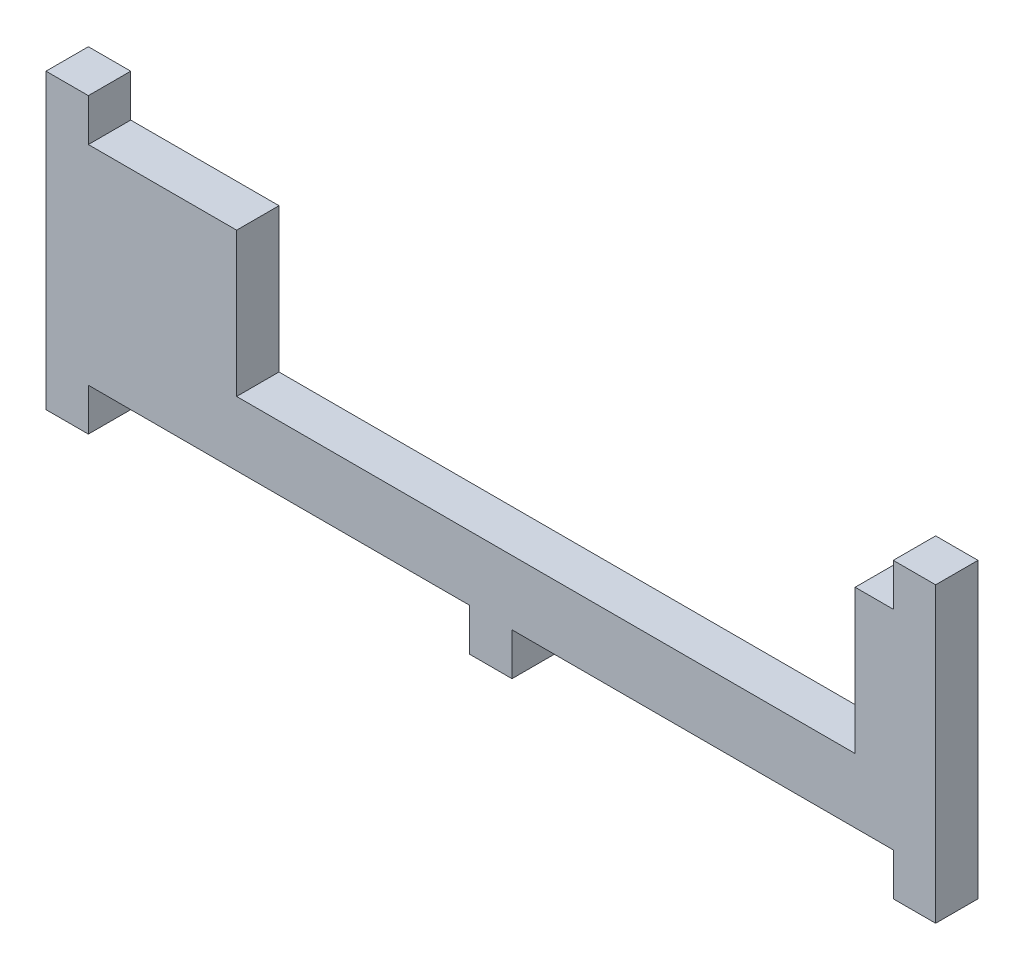
ISO-10303-21;
HEADER;
FILE_DESCRIPTION(('STEP AP214'),'2;1');
FILE_NAME('part.step','',(''),(''),'','','');
FILE_SCHEMA(('AUTOMOTIVE_DESIGN { 1 0 10303 214 1 1 1 1 }'));
ENDSEC;
DATA;
#1=APPLICATION_CONTEXT('core data for automotive mechanical design processes');
#2=APPLICATION_PROTOCOL_DEFINITION('international standard','automotive_design',2000,#1);
#3=PRODUCT_CONTEXT('',#1,'mechanical');
#4=PRODUCT('Part','Part','',(#3));
#5=PRODUCT_RELATED_PRODUCT_CATEGORY('part','',(#4));
#6=PRODUCT_DEFINITION_FORMATION('','',#4);
#7=PRODUCT_DEFINITION_CONTEXT('part definition',#1,'design');
#8=PRODUCT_DEFINITION('design','',#6,#7);
#9=PRODUCT_DEFINITION_SHAPE('','',#8);
#10=(LENGTH_UNIT() NAMED_UNIT(*) SI_UNIT(.MILLI.,.METRE.));
#11=(NAMED_UNIT(*) PLANE_ANGLE_UNIT() SI_UNIT($,.RADIAN.));
#12=(NAMED_UNIT(*) SI_UNIT($,.STERADIAN.) SOLID_ANGLE_UNIT());
#13=UNCERTAINTY_MEASURE_WITH_UNIT(LENGTH_MEASURE(1.E-05),#10,'distance_accuracy_value','');
#14=(GEOMETRIC_REPRESENTATION_CONTEXT(3) GLOBAL_UNCERTAINTY_ASSIGNED_CONTEXT((#13)) GLOBAL_UNIT_ASSIGNED_CONTEXT((#10,
#11,#12)) REPRESENTATION_CONTEXT('',''));
#15=CARTESIAN_POINT('',(0.,0.,0.));
#16=DIRECTION('',(0.,0.,1.));
#17=DIRECTION('',(1.,0.,0.));
#18=AXIS2_PLACEMENT_3D('',#15,#16,#17);
#19=CARTESIAN_POINT('',(-52.5,-6.15,5.));
#20=DIRECTION('',(0.,1.,0.));
#21=DIRECTION('',(0.,0.,1.));
#22=AXIS2_PLACEMENT_3D('',#19,#20,#21);
#23=PLANE('',#22);
#24=DIRECTION('',(0.,0.,-1.));
#25=VECTOR('',#24,1.);
#26=CARTESIAN_POINT('',(-2.5,-6.15,5.));
#27=LINE('',#26,#25);
#28=CARTESIAN_POINT('',(-2.5,-6.15,5.));
#29=VERTEX_POINT('',#28);
#30=CARTESIAN_POINT('',(-2.5,-6.15,0.));
#31=VERTEX_POINT('',#30);
#32=EDGE_CURVE('E58',#29,#31,#27,.T.);
#33=ORIENTED_EDGE('',*,*,#32,.F.);
#34=DIRECTION('',(1.,0.,0.));
#35=VECTOR('',#34,1.);
#36=CARTESIAN_POINT('',(-52.5,-6.15,5.));
#37=LINE('',#36,#35);
#38=CARTESIAN_POINT('',(-47.5,-6.15,5.));
#39=VERTEX_POINT('',#38);
#40=EDGE_CURVE('E12',#39,#29,#37,.T.);
#41=ORIENTED_EDGE('',*,*,#40,.F.);
#42=DIRECTION('',(0.,0.,1.));
#43=VECTOR('',#42,1.);
#44=CARTESIAN_POINT('',(-47.5,-6.15,5.));
#45=LINE('',#44,#43);
#46=CARTESIAN_POINT('',(-47.5,-6.15,0.));
#47=VERTEX_POINT('',#46);
#48=EDGE_CURVE('E298',#47,#39,#45,.T.);
#49=ORIENTED_EDGE('',*,*,#48,.F.);
#50=DIRECTION('',(1.,0.,0.));
#51=VECTOR('',#50,1.);
#52=CARTESIAN_POINT('',(-52.5,-6.15,0.));
#53=LINE('',#52,#51);
#54=EDGE_CURVE('E376',#47,#31,#53,.T.);
#55=ORIENTED_EDGE('',*,*,#54,.T.);
#56=EDGE_LOOP('',(#33,#41,#49,#55));
#57=FACE_BOUND('',#56,.T.);
#58=ADVANCED_FACE('F34',(#57),#23,.F.);
#59=DIRECTION('',(0.,0.,1.));
#60=VECTOR('',#59,1.);
#61=CARTESIAN_POINT('',(2.5,-6.15,5.));
#62=LINE('',#61,#60);
#63=CARTESIAN_POINT('',(2.50000000000001,-6.15,0.));
#64=VERTEX_POINT('',#63);
#65=CARTESIAN_POINT('',(2.50000000000001,-6.15,5.));
#66=VERTEX_POINT('',#65);
#67=EDGE_CURVE('E193',#64,#66,#62,.T.);
#68=ORIENTED_EDGE('',*,*,#67,.F.);
#69=CARTESIAN_POINT('',(47.5,-6.15,0.));
#70=VERTEX_POINT('',#69);
#71=EDGE_CURVE('E371',#64,#70,#53,.T.);
#72=ORIENTED_EDGE('',*,*,#71,.T.);
#73=DIRECTION('',(0.,0.,-1.));
#74=VECTOR('',#73,1.);
#75=CARTESIAN_POINT('',(47.5,-6.15,5.));
#76=LINE('',#75,#74);
#77=CARTESIAN_POINT('',(47.5,-6.15,5.));
#78=VERTEX_POINT('',#77);
#79=EDGE_CURVE('E282',#78,#70,#76,.T.);
#80=ORIENTED_EDGE('',*,*,#79,.F.);
#81=EDGE_CURVE('E38',#66,#78,#37,.T.);
#82=ORIENTED_EDGE('',*,*,#81,.F.);
#83=EDGE_LOOP('',(#68,#72,#80,#82));
#84=FACE_BOUND('',#83,.T.);
#85=ADVANCED_FACE('F385',(#84),#23,.F.);
#86=CARTESIAN_POINT('',(-52.5,18.45,5.));
#87=DIRECTION('',(0.,-1.,0.));
#88=DIRECTION('',(0.,0.,1.));
#89=AXIS2_PLACEMENT_3D('',#86,#87,#88);
#90=PLANE('',#89);
#91=DIRECTION('',(1.,0.,0.));
#92=VECTOR('',#91,1.);
#93=CARTESIAN_POINT('',(-52.5,18.45,5.));
#94=LINE('',#93,#92);
#95=CARTESIAN_POINT('',(-47.5,18.45,5.));
#96=VERTEX_POINT('',#95);
#97=CARTESIAN_POINT('',(-30.,18.45,5.));
#98=VERTEX_POINT('',#97);
#99=EDGE_CURVE('E268',#96,#98,#94,.T.);
#100=ORIENTED_EDGE('',*,*,#99,.T.);
#101=DIRECTION('',(0.,0.,1.));
#102=VECTOR('',#101,1.);
#103=CARTESIAN_POINT('',(-30.,18.45,0.));
#104=LINE('',#103,#102);
#105=CARTESIAN_POINT('',(-30.,18.45,0.));
#106=VERTEX_POINT('',#105);
#107=EDGE_CURVE('E196',#106,#98,#104,.T.);
#108=ORIENTED_EDGE('',*,*,#107,.F.);
#109=DIRECTION('',(1.,0.,0.));
#110=VECTOR('',#109,1.);
#111=CARTESIAN_POINT('',(-52.5,18.45,0.));
#112=LINE('',#111,#110);
#113=CARTESIAN_POINT('',(-47.5,18.45,0.));
#114=VERTEX_POINT('',#113);
#115=EDGE_CURVE('E329',#114,#106,#112,.T.);
#116=ORIENTED_EDGE('',*,*,#115,.F.);
#117=DIRECTION('',(0.,0.,1.));
#118=VECTOR('',#117,1.);
#119=CARTESIAN_POINT('',(-47.5,18.45,5.));
#120=LINE('',#119,#118);
#121=EDGE_CURVE('E247',#114,#96,#120,.T.);
#122=ORIENTED_EDGE('',*,*,#121,.T.);
#123=EDGE_LOOP('',(#100,#108,#116,#122));
#124=FACE_BOUND('',#123,.T.);
#125=ADVANCED_FACE('F342',(#124),#90,.F.);
#126=CARTESIAN_POINT('',(52.5,-6.15,5.));
#127=DIRECTION('',(-1.,0.,0.));
#128=DIRECTION('',(0.,0.,1.));
#129=AXIS2_PLACEMENT_3D('',#126,#127,#128);
#130=PLANE('',#129);
#131=DIRECTION('',(0.,1.,0.));
#132=VECTOR('',#131,1.);
#133=CARTESIAN_POINT('',(52.5,-6.15,0.));
#134=LINE('',#133,#132);
#135=CARTESIAN_POINT('',(52.5,-11.15,0.));
#136=VERTEX_POINT('',#135);
#137=CARTESIAN_POINT('',(52.5,23.45,0.));
#138=VERTEX_POINT('',#137);
#139=EDGE_CURVE('E325',#136,#138,#134,.T.);
#140=ORIENTED_EDGE('',*,*,#139,.T.);
#141=DIRECTION('',(0.,0.,1.));
#142=VECTOR('',#141,1.);
#143=CARTESIAN_POINT('',(52.5,23.45,5.));
#144=LINE('',#143,#142);
#145=CARTESIAN_POINT('',(52.5,23.45,5.));
#146=VERTEX_POINT('',#145);
#147=EDGE_CURVE('E233',#138,#146,#144,.T.);
#148=ORIENTED_EDGE('',*,*,#147,.T.);
#149=DIRECTION('',(0.,1.,0.));
#150=VECTOR('',#149,1.);
#151=CARTESIAN_POINT('',(52.5,-6.15,5.));
#152=LINE('',#151,#150);
#153=CARTESIAN_POINT('',(52.5,-11.15,5.));
#154=VERTEX_POINT('',#153);
#155=EDGE_CURVE('E312',#154,#146,#152,.T.);
#156=ORIENTED_EDGE('',*,*,#155,.F.);
#157=DIRECTION('',(0.,0.,1.));
#158=VECTOR('',#157,1.);
#159=CARTESIAN_POINT('',(52.5,-11.15,5.));
#160=LINE('',#159,#158);
#161=EDGE_CURVE('E285',#136,#154,#160,.T.);
#162=ORIENTED_EDGE('',*,*,#161,.F.);
#163=EDGE_LOOP('',(#140,#148,#156,#162));
#164=FACE_BOUND('',#163,.T.);
#165=ADVANCED_FACE('F36',(#164),#130,.F.);
#166=CARTESIAN_POINT('',(-52.5,-6.15,5.));
#167=DIRECTION('',(1.,0.,0.));
#168=DIRECTION('',(0.,0.,-1.));
#169=AXIS2_PLACEMENT_3D('',#166,#167,#168);
#170=PLANE('',#169);
#171=DIRECTION('',(0.,-1.,0.));
#172=VECTOR('',#171,1.);
#173=CARTESIAN_POINT('',(-52.5,-6.15,0.));
#174=LINE('',#173,#172);
#175=CARTESIAN_POINT('',(-52.5,23.45,0.));
#176=VERTEX_POINT('',#175);
#177=CARTESIAN_POINT('',(-52.5,-11.15,0.));
#178=VERTEX_POINT('',#177);
#179=EDGE_CURVE('E369',#176,#178,#174,.T.);
#180=ORIENTED_EDGE('',*,*,#179,.T.);
#181=DIRECTION('',(0.,0.,-1.));
#182=VECTOR('',#181,1.);
#183=CARTESIAN_POINT('',(-52.5,-11.15,5.));
#184=LINE('',#183,#182);
#185=CARTESIAN_POINT('',(-52.5,-11.15,5.));
#186=VERTEX_POINT('',#185);
#187=EDGE_CURVE('E299',#186,#178,#184,.T.);
#188=ORIENTED_EDGE('',*,*,#187,.F.);
#189=DIRECTION('',(0.,-1.,0.));
#190=VECTOR('',#189,1.);
#191=CARTESIAN_POINT('',(-52.5,-6.15,5.));
#192=LINE('',#191,#190);
#193=CARTESIAN_POINT('',(-52.5,23.45,5.));
#194=VERTEX_POINT('',#193);
#195=EDGE_CURVE('E378',#194,#186,#192,.T.);
#196=ORIENTED_EDGE('',*,*,#195,.F.);
#197=DIRECTION('',(0.,0.,-1.));
#198=VECTOR('',#197,1.);
#199=CARTESIAN_POINT('',(-52.5,23.45,5.));
#200=LINE('',#199,#198);
#201=EDGE_CURVE('E248',#194,#176,#200,.T.);
#202=ORIENTED_EDGE('',*,*,#201,.T.);
#203=EDGE_LOOP('',(#180,#188,#196,#202));
#204=FACE_BOUND('',#203,.T.);
#205=ADVANCED_FACE('F410',(#204),#170,.F.);
#206=CARTESIAN_POINT('',(0.,0.,5.));
#207=DIRECTION('',(0.,0.,-1.));
#208=DIRECTION('',(-1.,0.,0.));
#209=AXIS2_PLACEMENT_3D('',#206,#207,#208);
#210=PLANE('',#209);
#211=DIRECTION('',(1.,0.,0.));
#212=VECTOR('',#211,1.);
#213=CARTESIAN_POINT('',(-30.,1.45,5.));
#214=LINE('',#213,#212);
#215=CARTESIAN_POINT('',(-30.,1.45,5.));
#216=VERTEX_POINT('',#215);
#217=CARTESIAN_POINT('',(43.,1.45,5.));
#218=VERTEX_POINT('',#217);
#219=EDGE_CURVE('E207',#216,#218,#214,.T.);
#220=ORIENTED_EDGE('',*,*,#219,.F.);
#221=DIRECTION('',(0.,1.,0.));
#222=VECTOR('',#221,1.);
#223=CARTESIAN_POINT('',(-30.,1.45,5.));
#224=LINE('',#223,#222);
#225=EDGE_CURVE('E215',#216,#98,#224,.T.);
#226=ORIENTED_EDGE('',*,*,#225,.T.);
#227=ORIENTED_EDGE('',*,*,#99,.F.);
#228=DIRECTION('',(0.,-1.,0.));
#229=VECTOR('',#228,1.);
#230=CARTESIAN_POINT('',(-47.5,23.45,5.));
#231=LINE('',#230,#229);
#232=CARTESIAN_POINT('',(-47.5,23.45,5.));
#233=VERTEX_POINT('',#232);
#234=EDGE_CURVE('E259',#233,#96,#231,.T.);
#235=ORIENTED_EDGE('',*,*,#234,.F.);
#236=DIRECTION('',(-1.,0.,0.));
#237=VECTOR('',#236,1.);
#238=CARTESIAN_POINT('',(-52.5,23.45,5.));
#239=LINE('',#238,#237);
#240=EDGE_CURVE('E256',#233,#194,#239,.T.);
#241=ORIENTED_EDGE('',*,*,#240,.T.);
#242=ORIENTED_EDGE('',*,*,#195,.T.);
#243=DIRECTION('',(-1.,0.,0.));
#244=VECTOR('',#243,1.);
#245=CARTESIAN_POINT('',(-52.5,-11.15,5.));
#246=LINE('',#245,#244);
#247=CARTESIAN_POINT('',(-47.5,-11.15,5.));
#248=VERTEX_POINT('',#247);
#249=EDGE_CURVE('E306',#248,#186,#246,.T.);
#250=ORIENTED_EDGE('',*,*,#249,.F.);
#251=DIRECTION('',(0.,1.,0.));
#252=VECTOR('',#251,1.);
#253=CARTESIAN_POINT('',(-47.5,-11.15,5.));
#254=LINE('',#253,#252);
#255=EDGE_CURVE('E309',#248,#39,#254,.T.);
#256=ORIENTED_EDGE('',*,*,#255,.T.);
#257=ORIENTED_EDGE('',*,*,#40,.T.);
#258=DIRECTION('',(0.,1.,0.));
#259=VECTOR('',#258,1.);
#260=CARTESIAN_POINT('',(-2.5,-11.15,5.));
#261=LINE('',#260,#259);
#262=CARTESIAN_POINT('',(-2.5,-11.15,5.));
#263=VERTEX_POINT('',#262);
#264=EDGE_CURVE('E395',#263,#29,#261,.T.);
#265=ORIENTED_EDGE('',*,*,#264,.F.);
#266=DIRECTION('',(-1.,0.,0.));
#267=VECTOR('',#266,1.);
#268=CARTESIAN_POINT('',(-2.5,-11.15,5.));
#269=LINE('',#268,#267);
#270=CARTESIAN_POINT('',(2.5,-11.15,5.));
#271=VERTEX_POINT('',#270);
#272=EDGE_CURVE('E189',#271,#263,#269,.T.);
#273=ORIENTED_EDGE('',*,*,#272,.F.);
#274=DIRECTION('',(0.,1.,0.));
#275=VECTOR('',#274,1.);
#276=CARTESIAN_POINT('',(2.5,-11.15,5.));
#277=LINE('',#276,#275);
#278=EDGE_CURVE('E200',#271,#66,#277,.T.);
#279=ORIENTED_EDGE('',*,*,#278,.T.);
#280=ORIENTED_EDGE('',*,*,#81,.T.);
#281=DIRECTION('',(0.,1.,0.));
#282=VECTOR('',#281,1.);
#283=CARTESIAN_POINT('',(47.5,-11.15,5.));
#284=LINE('',#283,#282);
#285=CARTESIAN_POINT('',(47.5,-11.15,5.));
#286=VERTEX_POINT('',#285);
#287=EDGE_CURVE('E290',#286,#78,#284,.T.);
#288=ORIENTED_EDGE('',*,*,#287,.F.);
#289=DIRECTION('',(-1.,0.,0.));
#290=VECTOR('',#289,1.);
#291=CARTESIAN_POINT('',(47.5,-11.15,5.));
#292=LINE('',#291,#290);
#293=EDGE_CURVE('E288',#154,#286,#292,.T.);
#294=ORIENTED_EDGE('',*,*,#293,.F.);
#295=ORIENTED_EDGE('',*,*,#155,.T.);
#296=DIRECTION('',(-1.,0.,0.));
#297=VECTOR('',#296,1.);
#298=CARTESIAN_POINT('',(47.5,23.45,5.));
#299=LINE('',#298,#297);
#300=CARTESIAN_POINT('',(47.5,23.45,5.));
#301=VERTEX_POINT('',#300);
#302=EDGE_CURVE('E236',#146,#301,#299,.T.);
#303=ORIENTED_EDGE('',*,*,#302,.T.);
#304=DIRECTION('',(0.,-1.,0.));
#305=VECTOR('',#304,1.);
#306=CARTESIAN_POINT('',(47.5,23.45,5.));
#307=LINE('',#306,#305);
#308=CARTESIAN_POINT('',(47.5,18.45,5.));
#309=VERTEX_POINT('',#308);
#310=EDGE_CURVE('E239',#301,#309,#307,.T.);
#311=ORIENTED_EDGE('',*,*,#310,.T.);
#312=CARTESIAN_POINT('',(43.,18.45,5.));
#313=VERTEX_POINT('',#312);
#314=EDGE_CURVE('E330',#313,#309,#94,.T.);
#315=ORIENTED_EDGE('',*,*,#314,.F.);
#316=DIRECTION('',(0.,1.,0.));
#317=VECTOR('',#316,1.);
#318=CARTESIAN_POINT('',(43.,1.45,5.));
#319=LINE('',#318,#317);
#320=EDGE_CURVE('E224',#218,#313,#319,.T.);
#321=ORIENTED_EDGE('',*,*,#320,.F.);
#322=EDGE_LOOP('',(#220,#226,#227,#235,#241,#242,#250,#256,#257,#265,#273,#279,#280,#288,#294,
#295,#303,#311,#315,#321));
#323=FACE_BOUND('',#322,.T.);
#324=ADVANCED_FACE('F347',(#323),#210,.F.);
#325=CARTESIAN_POINT('',(0.,0.,0.));
#326=DIRECTION('',(0.,0.,-1.));
#327=DIRECTION('',(-1.,0.,0.));
#328=AXIS2_PLACEMENT_3D('',#325,#326,#327);
#329=PLANE('',#328);
#330=DIRECTION('',(0.,1.,0.));
#331=VECTOR('',#330,1.);
#332=CARTESIAN_POINT('',(-30.,1.45,0.));
#333=LINE('',#332,#331);
#334=CARTESIAN_POINT('',(-30.,1.45,0.));
#335=VERTEX_POINT('',#334);
#336=EDGE_CURVE('E218',#335,#106,#333,.T.);
#337=ORIENTED_EDGE('',*,*,#336,.F.);
#338=DIRECTION('',(-1.,0.,0.));
#339=VECTOR('',#338,1.);
#340=CARTESIAN_POINT('',(-30.,1.45,0.));
#341=LINE('',#340,#339);
#342=CARTESIAN_POINT('',(43.,1.45,0.));
#343=VERTEX_POINT('',#342);
#344=EDGE_CURVE('E213',#343,#335,#341,.T.);
#345=ORIENTED_EDGE('',*,*,#344,.F.);
#346=DIRECTION('',(0.,1.,0.));
#347=VECTOR('',#346,1.);
#348=CARTESIAN_POINT('',(43.,1.45,0.));
#349=LINE('',#348,#347);
#350=CARTESIAN_POINT('',(43.,18.45,0.));
#351=VERTEX_POINT('',#350);
#352=EDGE_CURVE('E221',#343,#351,#349,.T.);
#353=ORIENTED_EDGE('',*,*,#352,.T.);
#354=CARTESIAN_POINT('',(47.5,18.45,0.));
#355=VERTEX_POINT('',#354);
#356=EDGE_CURVE('E275',#351,#355,#112,.T.);
#357=ORIENTED_EDGE('',*,*,#356,.T.);
#358=DIRECTION('',(0.,-1.,0.));
#359=VECTOR('',#358,1.);
#360=CARTESIAN_POINT('',(47.5,23.45,0.));
#361=LINE('',#360,#359);
#362=CARTESIAN_POINT('',(47.5,23.45,0.));
#363=VERTEX_POINT('',#362);
#364=EDGE_CURVE('E244',#363,#355,#361,.T.);
#365=ORIENTED_EDGE('',*,*,#364,.F.);
#366=DIRECTION('',(1.,0.,0.));
#367=VECTOR('',#366,1.);
#368=CARTESIAN_POINT('',(47.5,23.45,0.));
#369=LINE('',#368,#367);
#370=EDGE_CURVE('E230',#363,#138,#369,.T.);
#371=ORIENTED_EDGE('',*,*,#370,.T.);
#372=ORIENTED_EDGE('',*,*,#139,.F.);
#373=DIRECTION('',(1.,0.,0.));
#374=VECTOR('',#373,1.);
#375=CARTESIAN_POINT('',(47.5,-11.15,0.));
#376=LINE('',#375,#374);
#377=CARTESIAN_POINT('',(47.5,-11.15,0.));
#378=VERTEX_POINT('',#377);
#379=EDGE_CURVE('E281',#378,#136,#376,.T.);
#380=ORIENTED_EDGE('',*,*,#379,.F.);
#381=DIRECTION('',(0.,1.,0.));
#382=VECTOR('',#381,1.);
#383=CARTESIAN_POINT('',(47.5,-11.15,0.));
#384=LINE('',#383,#382);
#385=EDGE_CURVE('E295',#378,#70,#384,.T.);
#386=ORIENTED_EDGE('',*,*,#385,.T.);
#387=ORIENTED_EDGE('',*,*,#71,.F.);
#388=DIRECTION('',(0.,1.,0.));
#389=VECTOR('',#388,1.);
#390=CARTESIAN_POINT('',(2.50000000000001,-11.15,0.));
#391=LINE('',#390,#389);
#392=CARTESIAN_POINT('',(2.50000000000001,-11.15,0.));
#393=VERTEX_POINT('',#392);
#394=EDGE_CURVE('E180',#393,#64,#391,.T.);
#395=ORIENTED_EDGE('',*,*,#394,.F.);
#396=DIRECTION('',(1.,0.,0.));
#397=VECTOR('',#396,1.);
#398=CARTESIAN_POINT('',(-2.5,-11.15,0.));
#399=LINE('',#398,#397);
#400=CARTESIAN_POINT('',(-2.5,-11.15,0.));
#401=VERTEX_POINT('',#400);
#402=EDGE_CURVE('E172',#401,#393,#399,.T.);
#403=ORIENTED_EDGE('',*,*,#402,.F.);
#404=DIRECTION('',(0.,1.,0.));
#405=VECTOR('',#404,1.);
#406=CARTESIAN_POINT('',(-2.5,-11.15,0.));
#407=LINE('',#406,#405);
#408=EDGE_CURVE('E178',#401,#31,#407,.T.);
#409=ORIENTED_EDGE('',*,*,#408,.T.);
#410=ORIENTED_EDGE('',*,*,#54,.F.);
#411=DIRECTION('',(0.,1.,0.));
#412=VECTOR('',#411,1.);
#413=CARTESIAN_POINT('',(-47.5,-11.15,0.));
#414=LINE('',#413,#412);
#415=CARTESIAN_POINT('',(-47.5,-11.15,0.));
#416=VERTEX_POINT('',#415);
#417=EDGE_CURVE('E320',#416,#47,#414,.T.);
#418=ORIENTED_EDGE('',*,*,#417,.F.);
#419=DIRECTION('',(1.,0.,0.));
#420=VECTOR('',#419,1.);
#421=CARTESIAN_POINT('',(-52.5,-11.15,0.));
#422=LINE('',#421,#420);
#423=EDGE_CURVE('E302',#178,#416,#422,.T.);
#424=ORIENTED_EDGE('',*,*,#423,.F.);
#425=ORIENTED_EDGE('',*,*,#179,.F.);
#426=DIRECTION('',(1.,0.,0.));
#427=VECTOR('',#426,1.);
#428=CARTESIAN_POINT('',(-52.5,23.45,0.));
#429=LINE('',#428,#427);
#430=CARTESIAN_POINT('',(-47.5,23.45,0.));
#431=VERTEX_POINT('',#430);
#432=EDGE_CURVE('E251',#176,#431,#429,.T.);
#433=ORIENTED_EDGE('',*,*,#432,.T.);
#434=DIRECTION('',(0.,-1.,0.));
#435=VECTOR('',#434,1.);
#436=CARTESIAN_POINT('',(-47.5,23.45,0.));
#437=LINE('',#436,#435);
#438=EDGE_CURVE('E271',#431,#114,#437,.T.);
#439=ORIENTED_EDGE('',*,*,#438,.T.);
#440=ORIENTED_EDGE('',*,*,#115,.T.);
#441=EDGE_LOOP('',(#337,#345,#353,#357,#365,#371,#372,#380,#386,#387,#395,#403,#409,#410,#418,
#424,#425,#433,#439,#440));
#442=FACE_BOUND('',#441,.T.);
#443=ADVANCED_FACE('F175',(#442),#329,.T.);
#444=CARTESIAN_POINT('',(-47.5,-11.15,5.));
#445=DIRECTION('',(-1.,0.,0.));
#446=DIRECTION('',(0.,0.,1.));
#447=AXIS2_PLACEMENT_3D('',#444,#445,#446);
#448=PLANE('',#447);
#449=ORIENTED_EDGE('',*,*,#48,.T.);
#450=ORIENTED_EDGE('',*,*,#255,.F.);
#451=DIRECTION('',(0.,0.,1.));
#452=VECTOR('',#451,1.);
#453=CARTESIAN_POINT('',(-47.5,-11.15,5.));
#454=LINE('',#453,#452);
#455=EDGE_CURVE('E304',#416,#248,#454,.T.);
#456=ORIENTED_EDGE('',*,*,#455,.F.);
#457=ORIENTED_EDGE('',*,*,#417,.T.);
#458=EDGE_LOOP('',(#449,#450,#456,#457));
#459=FACE_BOUND('',#458,.T.);
#460=ADVANCED_FACE('F401',(#459),#448,.F.);
#461=CARTESIAN_POINT('',(0.,-11.15,0.));
#462=DIRECTION('',(0.,-1.,0.));
#463=DIRECTION('',(0.,0.,-1.));
#464=AXIS2_PLACEMENT_3D('',#461,#462,#463);
#465=PLANE('',#464);
#466=ORIENTED_EDGE('',*,*,#187,.T.);
#467=ORIENTED_EDGE('',*,*,#423,.T.);
#468=ORIENTED_EDGE('',*,*,#455,.T.);
#469=ORIENTED_EDGE('',*,*,#249,.T.);
#470=EDGE_LOOP('',(#466,#467,#468,#469));
#471=FACE_BOUND('',#470,.T.);
#472=ADVANCED_FACE('F408',(#471),#465,.T.);
#473=CARTESIAN_POINT('',(47.5,-11.15,5.));
#474=DIRECTION('',(1.,0.,0.));
#475=DIRECTION('',(0.,0.,-1.));
#476=AXIS2_PLACEMENT_3D('',#473,#474,#475);
#477=PLANE('',#476);
#478=ORIENTED_EDGE('',*,*,#79,.T.);
#479=ORIENTED_EDGE('',*,*,#385,.F.);
#480=DIRECTION('',(0.,0.,-1.));
#481=VECTOR('',#480,1.);
#482=CARTESIAN_POINT('',(47.5,-11.15,5.));
#483=LINE('',#482,#481);
#484=EDGE_CURVE('E278',#286,#378,#483,.T.);
#485=ORIENTED_EDGE('',*,*,#484,.F.);
#486=ORIENTED_EDGE('',*,*,#287,.T.);
#487=EDGE_LOOP('',(#478,#479,#485,#486));
#488=FACE_BOUND('',#487,.T.);
#489=ADVANCED_FACE('F388',(#488),#477,.F.);
#490=CARTESIAN_POINT('',(0.,-11.15,0.));
#491=DIRECTION('',(0.,-1.,0.));
#492=DIRECTION('',(0.,0.,-1.));
#493=AXIS2_PLACEMENT_3D('',#490,#491,#492);
#494=PLANE('',#493);
#495=ORIENTED_EDGE('',*,*,#484,.T.);
#496=ORIENTED_EDGE('',*,*,#379,.T.);
#497=ORIENTED_EDGE('',*,*,#161,.T.);
#498=ORIENTED_EDGE('',*,*,#293,.T.);
#499=EDGE_LOOP('',(#495,#496,#497,#498));
#500=FACE_BOUND('',#499,.T.);
#501=ADVANCED_FACE('F390',(#500),#494,.T.);
#502=ORIENTED_EDGE('',*,*,#356,.F.);
#503=DIRECTION('',(0.,0.,-1.));
#504=VECTOR('',#503,1.);
#505=CARTESIAN_POINT('',(43.,18.45,0.));
#506=LINE('',#505,#504);
#507=EDGE_CURVE('E198',#313,#351,#506,.T.);
#508=ORIENTED_EDGE('',*,*,#507,.F.);
#509=ORIENTED_EDGE('',*,*,#314,.T.);
#510=DIRECTION('',(0.,0.,-1.));
#511=VECTOR('',#510,1.);
#512=CARTESIAN_POINT('',(47.5,18.45,5.));
#513=LINE('',#512,#511);
#514=EDGE_CURVE('E220',#309,#355,#513,.T.);
#515=ORIENTED_EDGE('',*,*,#514,.T.);
#516=EDGE_LOOP('',(#502,#508,#509,#515));
#517=FACE_BOUND('',#516,.T.);
#518=ADVANCED_FACE('F357',(#517),#90,.F.);
#519=CARTESIAN_POINT('',(-47.5,23.45,5.));
#520=DIRECTION('',(-1.,0.,0.));
#521=DIRECTION('',(0.,0.,1.));
#522=AXIS2_PLACEMENT_3D('',#519,#520,#521);
#523=PLANE('',#522);
#524=ORIENTED_EDGE('',*,*,#121,.F.);
#525=ORIENTED_EDGE('',*,*,#438,.F.);
#526=DIRECTION('',(0.,0.,1.));
#527=VECTOR('',#526,1.);
#528=CARTESIAN_POINT('',(-47.5,23.45,5.));
#529=LINE('',#528,#527);
#530=EDGE_CURVE('E254',#431,#233,#529,.T.);
#531=ORIENTED_EDGE('',*,*,#530,.T.);
#532=ORIENTED_EDGE('',*,*,#234,.T.);
#533=EDGE_LOOP('',(#524,#525,#531,#532));
#534=FACE_BOUND('',#533,.T.);
#535=ADVANCED_FACE('F417',(#534),#523,.F.);
#536=CARTESIAN_POINT('',(0.,23.45,0.));
#537=DIRECTION('',(0.,1.,0.));
#538=DIRECTION('',(0.,0.,-1.));
#539=AXIS2_PLACEMENT_3D('',#536,#537,#538);
#540=PLANE('',#539);
#541=ORIENTED_EDGE('',*,*,#201,.F.);
#542=ORIENTED_EDGE('',*,*,#240,.F.);
#543=ORIENTED_EDGE('',*,*,#530,.F.);
#544=ORIENTED_EDGE('',*,*,#432,.F.);
#545=EDGE_LOOP('',(#541,#542,#543,#544));
#546=FACE_BOUND('',#545,.T.);
#547=ADVANCED_FACE('F414',(#546),#540,.T.);
#548=CARTESIAN_POINT('',(47.5,23.45,5.));
#549=DIRECTION('',(1.,0.,0.));
#550=DIRECTION('',(0.,0.,-1.));
#551=AXIS2_PLACEMENT_3D('',#548,#549,#550);
#552=PLANE('',#551);
#553=ORIENTED_EDGE('',*,*,#514,.F.);
#554=ORIENTED_EDGE('',*,*,#310,.F.);
#555=DIRECTION('',(0.,0.,-1.));
#556=VECTOR('',#555,1.);
#557=CARTESIAN_POINT('',(47.5,23.45,5.));
#558=LINE('',#557,#556);
#559=EDGE_CURVE('E228',#301,#363,#558,.T.);
#560=ORIENTED_EDGE('',*,*,#559,.T.);
#561=ORIENTED_EDGE('',*,*,#364,.T.);
#562=EDGE_LOOP('',(#553,#554,#560,#561));
#563=FACE_BOUND('',#562,.T.);
#564=ADVANCED_FACE('F361',(#563),#552,.F.);
#565=CARTESIAN_POINT('',(0.,23.45,0.));
#566=DIRECTION('',(0.,1.,0.));
#567=DIRECTION('',(0.,0.,-1.));
#568=AXIS2_PLACEMENT_3D('',#565,#566,#567);
#569=PLANE('',#568);
#570=ORIENTED_EDGE('',*,*,#559,.F.);
#571=ORIENTED_EDGE('',*,*,#302,.F.);
#572=ORIENTED_EDGE('',*,*,#147,.F.);
#573=ORIENTED_EDGE('',*,*,#370,.F.);
#574=EDGE_LOOP('',(#570,#571,#572,#573));
#575=FACE_BOUND('',#574,.T.);
#576=ADVANCED_FACE('F366',(#575),#569,.T.);
#577=CARTESIAN_POINT('',(-30.,1.45,0.));
#578=DIRECTION('',(-1.,0.,0.));
#579=DIRECTION('',(0.,0.,1.));
#580=AXIS2_PLACEMENT_3D('',#577,#578,#579);
#581=PLANE('',#580);
#582=ORIENTED_EDGE('',*,*,#107,.T.);
#583=ORIENTED_EDGE('',*,*,#225,.F.);
#584=DIRECTION('',(0.,0.,1.));
#585=VECTOR('',#584,1.);
#586=CARTESIAN_POINT('',(-30.,1.45,0.));
#587=LINE('',#586,#585);
#588=EDGE_CURVE('E204',#335,#216,#587,.T.);
#589=ORIENTED_EDGE('',*,*,#588,.F.);
#590=ORIENTED_EDGE('',*,*,#336,.T.);
#591=EDGE_LOOP('',(#582,#583,#589,#590));
#592=FACE_BOUND('',#591,.T.);
#593=ADVANCED_FACE('F350',(#592),#581,.F.);
#594=CARTESIAN_POINT('',(43.,1.45,0.));
#595=DIRECTION('',(1.,0.,0.));
#596=DIRECTION('',(0.,0.,-1.));
#597=AXIS2_PLACEMENT_3D('',#594,#595,#596);
#598=PLANE('',#597);
#599=ORIENTED_EDGE('',*,*,#507,.T.);
#600=ORIENTED_EDGE('',*,*,#352,.F.);
#601=DIRECTION('',(0.,0.,-1.));
#602=VECTOR('',#601,1.);
#603=CARTESIAN_POINT('',(43.,1.45,0.));
#604=LINE('',#603,#602);
#605=EDGE_CURVE('E210',#218,#343,#604,.T.);
#606=ORIENTED_EDGE('',*,*,#605,.F.);
#607=ORIENTED_EDGE('',*,*,#320,.T.);
#608=EDGE_LOOP('',(#599,#600,#606,#607));
#609=FACE_BOUND('',#608,.T.);
#610=ADVANCED_FACE('F481',(#609),#598,.F.);
#611=CARTESIAN_POINT('',(0.,1.45,0.));
#612=DIRECTION('',(0.,1.,0.));
#613=DIRECTION('',(0.,0.,1.));
#614=AXIS2_PLACEMENT_3D('',#611,#612,#613);
#615=PLANE('',#614);
#616=ORIENTED_EDGE('',*,*,#588,.T.);
#617=ORIENTED_EDGE('',*,*,#219,.T.);
#618=ORIENTED_EDGE('',*,*,#605,.T.);
#619=ORIENTED_EDGE('',*,*,#344,.T.);
#620=EDGE_LOOP('',(#616,#617,#618,#619));
#621=FACE_BOUND('',#620,.T.);
#622=ADVANCED_FACE('F352',(#621),#615,.T.);
#623=CARTESIAN_POINT('',(-2.5,-11.15,5.));
#624=DIRECTION('',(1.,0.,0.));
#625=DIRECTION('',(0.,0.,-1.));
#626=AXIS2_PLACEMENT_3D('',#623,#624,#625);
#627=PLANE('',#626);
#628=ORIENTED_EDGE('',*,*,#32,.T.);
#629=ORIENTED_EDGE('',*,*,#408,.F.);
#630=DIRECTION('',(0.,0.,-1.));
#631=VECTOR('',#630,1.);
#632=CARTESIAN_POINT('',(-2.5,-11.15,5.));
#633=LINE('',#632,#631);
#634=EDGE_CURVE('E184',#263,#401,#633,.T.);
#635=ORIENTED_EDGE('',*,*,#634,.F.);
#636=ORIENTED_EDGE('',*,*,#264,.T.);
#637=EDGE_LOOP('',(#628,#629,#635,#636));
#638=FACE_BOUND('',#637,.T.);
#639=ADVANCED_FACE('F195',(#638),#627,.F.);
#640=CARTESIAN_POINT('',(2.5,-11.15,5.));
#641=DIRECTION('',(-1.,0.,0.));
#642=DIRECTION('',(0.,0.,1.));
#643=AXIS2_PLACEMENT_3D('',#640,#641,#642);
#644=PLANE('',#643);
#645=ORIENTED_EDGE('',*,*,#67,.T.);
#646=ORIENTED_EDGE('',*,*,#278,.F.);
#647=DIRECTION('',(0.,0.,1.));
#648=VECTOR('',#647,1.);
#649=CARTESIAN_POINT('',(2.5,-11.15,5.));
#650=LINE('',#649,#648);
#651=EDGE_CURVE('E183',#393,#271,#650,.T.);
#652=ORIENTED_EDGE('',*,*,#651,.F.);
#653=ORIENTED_EDGE('',*,*,#394,.T.);
#654=EDGE_LOOP('',(#645,#646,#652,#653));
#655=FACE_BOUND('',#654,.T.);
#656=ADVANCED_FACE('F393',(#655),#644,.F.);
#657=CARTESIAN_POINT('',(0.,-11.15,0.));
#658=DIRECTION('',(0.,-1.,0.));
#659=DIRECTION('',(0.,0.,-1.));
#660=AXIS2_PLACEMENT_3D('',#657,#658,#659);
#661=PLANE('',#660);
#662=ORIENTED_EDGE('',*,*,#634,.T.);
#663=ORIENTED_EDGE('',*,*,#402,.T.);
#664=ORIENTED_EDGE('',*,*,#651,.T.);
#665=ORIENTED_EDGE('',*,*,#272,.T.);
#666=EDGE_LOOP('',(#662,#663,#664,#665));
#667=FACE_BOUND('',#666,.T.);
#668=ADVANCED_FACE('F187',(#667),#661,.T.);
#669=CLOSED_SHELL('',(#58,#85,#125,#165,#205,#324,#443,#460,#472,#489,#501,#518,#535,#547,#564,
#576,#593,#610,#622,#639,#656,#668));
#670=MANIFOLD_SOLID_BREP('B2',#669);
#671=ADVANCED_BREP_SHAPE_REPRESENTATION('',(#18,#670),#14);
#672=SHAPE_DEFINITION_REPRESENTATION(#9,#671);
ENDSEC;
END-ISO-10303-21;
